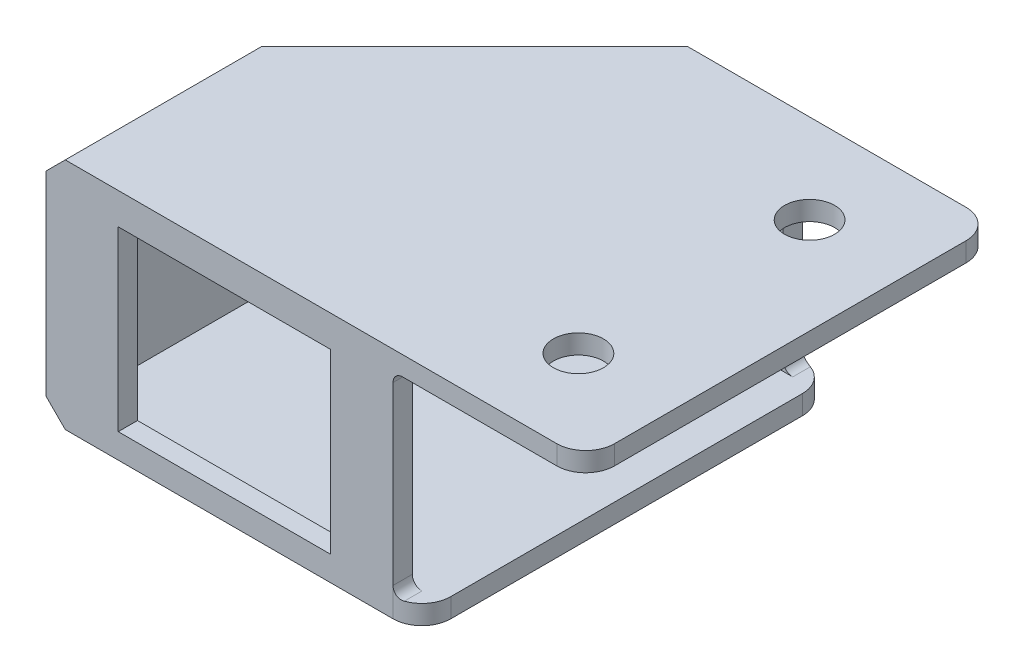
ISO-10303-21;
HEADER;
FILE_DESCRIPTION(('STEP AP214'),'2;1');
FILE_NAME('part.step','',(''),(''),'','','');
FILE_SCHEMA(('AUTOMOTIVE_DESIGN { 1 0 10303 214 1 1 1 1 }'));
ENDSEC;
DATA;
#1=APPLICATION_CONTEXT('core data for automotive mechanical design processes');
#2=APPLICATION_PROTOCOL_DEFINITION('international standard','automotive_design',2000,#1);
#3=PRODUCT_CONTEXT('',#1,'mechanical');
#4=PRODUCT('Part','Part','',(#3));
#5=PRODUCT_RELATED_PRODUCT_CATEGORY('part','',(#4));
#6=PRODUCT_DEFINITION_FORMATION('','',#4);
#7=PRODUCT_DEFINITION_CONTEXT('part definition',#1,'design');
#8=PRODUCT_DEFINITION('design','',#6,#7);
#9=PRODUCT_DEFINITION_SHAPE('','',#8);
#10=(LENGTH_UNIT() NAMED_UNIT(*) SI_UNIT(.MILLI.,.METRE.));
#11=(NAMED_UNIT(*) PLANE_ANGLE_UNIT() SI_UNIT($,.RADIAN.));
#12=(NAMED_UNIT(*) SI_UNIT($,.STERADIAN.) SOLID_ANGLE_UNIT());
#13=UNCERTAINTY_MEASURE_WITH_UNIT(LENGTH_MEASURE(1.E-05),#10,'distance_accuracy_value','');
#14=(GEOMETRIC_REPRESENTATION_CONTEXT(3) GLOBAL_UNCERTAINTY_ASSIGNED_CONTEXT((#13)) GLOBAL_UNIT_ASSIGNED_CONTEXT((#10,
#11,#12)) REPRESENTATION_CONTEXT('',''));
#15=CARTESIAN_POINT('',(0.,0.,0.));
#16=DIRECTION('',(0.,0.,1.));
#17=DIRECTION('',(1.,0.,0.));
#18=AXIS2_PLACEMENT_3D('',#15,#16,#17);
#19=CARTESIAN_POINT('',(26.409748294383,-43.8545194167415,42.5));
#20=DIRECTION('',(1.,0.,0.));
#21=DIRECTION('',(0.,0.,-1.));
#22=AXIS2_PLACEMENT_3D('',#19,#20,#21);
#23=PLANE('',#22);
#24=DIRECTION('',(0.,-1.,0.));
#25=VECTOR('',#24,1.);
#26=CARTESIAN_POINT('',(26.409748294383,3.77470202541257,40.5));
#27=LINE('',#26,#25);
#28=CARTESIAN_POINT('',(26.409748294383,12.8997020254126,40.5));
#29=VERTEX_POINT('',#28);
#30=CARTESIAN_POINT('',(26.409748294383,-5.35029797458743,40.5));
#31=VERTEX_POINT('',#30);
#32=EDGE_CURVE('E228',#29,#31,#27,.T.);
#33=ORIENTED_EDGE('',*,*,#32,.F.);
#34=DIRECTION('',(0.,0.,-1.));
#35=VECTOR('',#34,1.);
#36=CARTESIAN_POINT('',(26.409748294383,12.8997020254126,42.5));
#37=LINE('',#36,#35);
#38=CARTESIAN_POINT('',(26.409748294383,12.8997020254126,42.5));
#39=VERTEX_POINT('',#38);
#40=EDGE_CURVE('E426',#29,#39,#37,.F.);
#41=ORIENTED_EDGE('',*,*,#40,.T.);
#42=DIRECTION('',(0.,-1.,0.));
#43=VECTOR('',#42,1.);
#44=CARTESIAN_POINT('',(26.409748294383,-43.8545194167415,42.5));
#45=LINE('',#44,#43);
#46=CARTESIAN_POINT('',(26.409748294383,-5.35029797458743,42.5));
#47=VERTEX_POINT('',#46);
#48=EDGE_CURVE('E315',#39,#47,#45,.T.);
#49=ORIENTED_EDGE('',*,*,#48,.T.);
#50=DIRECTION('',(0.,0.,-1.));
#51=VECTOR('',#50,1.);
#52=CARTESIAN_POINT('',(26.409748294383,-5.35029797458743,40.5));
#53=LINE('',#52,#51);
#54=EDGE_CURVE('E423',#47,#31,#53,.T.);
#55=ORIENTED_EDGE('',*,*,#54,.T.);
#56=EDGE_LOOP('',(#33,#41,#49,#55));
#57=FACE_BOUND('',#56,.T.);
#58=ADVANCED_FACE('F35',(#57),#23,.T.);
#59=CARTESIAN_POINT('',(-7.620251705617,-43.8545194167415,42.5));
#60=DIRECTION('',(1.,0.,0.));
#61=DIRECTION('',(0.,0.,-1.));
#62=AXIS2_PLACEMENT_3D('',#59,#60,#61);
#63=PLANE('',#62);
#64=DIRECTION('',(0.,0.,-1.));
#65=VECTOR('',#64,1.);
#66=CARTESIAN_POINT('',(-7.620251705617,-6.35029797458743,42.5));
#67=LINE('',#66,#65);
#68=CARTESIAN_POINT('',(-7.620251705617,-6.35029797458743,40.5));
#69=VERTEX_POINT('',#68);
#70=CARTESIAN_POINT('',(-7.620251705617,-6.35029797458743,22.0784271247462));
#71=VERTEX_POINT('',#70);
#72=EDGE_CURVE('E319',#69,#71,#67,.T.);
#73=ORIENTED_EDGE('',*,*,#72,.T.);
#74=DIRECTION('',(0.,-1.,0.));
#75=VECTOR('',#74,1.);
#76=CARTESIAN_POINT('',(-7.62025170564407,500000.,22.0784271247462));
#77=LINE('',#76,#75);
#78=CARTESIAN_POINT('',(-7.62025170561699,13.899702025526,22.0784271247462));
#79=VERTEX_POINT('',#78);
#80=EDGE_CURVE('E237',#79,#71,#77,.T.);
#81=ORIENTED_EDGE('',*,*,#80,.F.);
#82=DIRECTION('',(0.,0.,-1.));
#83=VECTOR('',#82,1.);
#84=CARTESIAN_POINT('',(-7.62025170561699,13.8997020254126,42.5));
#85=LINE('',#84,#83);
#86=CARTESIAN_POINT('',(-7.62025170561699,13.8997020254126,40.5));
#87=VERTEX_POINT('',#86);
#88=EDGE_CURVE('E244',#87,#79,#85,.T.);
#89=ORIENTED_EDGE('',*,*,#88,.F.);
#90=DIRECTION('',(0.,-1.,0.));
#91=VECTOR('',#90,1.);
#92=CARTESIAN_POINT('',(-7.62025170561699,13.8997020254126,40.5));
#93=LINE('',#92,#91);
#94=EDGE_CURVE('E303',#87,#69,#93,.T.);
#95=ORIENTED_EDGE('',*,*,#94,.T.);
#96=EDGE_LOOP('',(#73,#81,#89,#95));
#97=FACE_BOUND('',#96,.T.);
#98=ADVANCED_FACE('F493',(#97),#63,.T.);
#99=CARTESIAN_POINT('',(18.394748294383,15.8997020254126,42.5));
#100=DIRECTION('',(0.,1.,0.));
#101=DIRECTION('',(0.,0.,1.));
#102=AXIS2_PLACEMENT_3D('',#99,#100,#101);
#103=PLANE('',#102);
#104=DIRECTION('',(1.,0.,0.));
#105=VECTOR('',#104,1.);
#106=CARTESIAN_POINT('',(18.394748294383,15.8997020254126,0.));
#107=LINE('',#106,#105);
#108=CARTESIAN_POINT('',(14.4581754191293,15.8997020254126,0.));
#109=VERTEX_POINT('',#108);
#110=CARTESIAN_POINT('',(43.409748294383,15.8997020254126,0.));
#111=VERTEX_POINT('',#110);
#112=EDGE_CURVE('E306',#109,#111,#107,.T.);
#113=ORIENTED_EDGE('',*,*,#112,.F.);
#114=DIRECTION('',(-0.707106781186548,0.,0.707106781186548));
#115=VECTOR('',#114,1.);
#116=CARTESIAN_POINT('',(-8.20603814324379,15.8997020254126,22.6642135623731));
#117=LINE('',#116,#115);
#118=CARTESIAN_POINT('',(-7.62025170561698,15.8997020254126,22.0784271247463));
#119=VERTEX_POINT('',#118);
#120=EDGE_CURVE('E388',#109,#119,#117,.T.);
#121=ORIENTED_EDGE('',*,*,#120,.T.);
#122=DIRECTION('',(0.,0.,1.));
#123=VECTOR('',#122,1.);
#124=CARTESIAN_POINT('',(-7.62025170561698,15.8997020254126,42.5));
#125=LINE('',#124,#123);
#126=CARTESIAN_POINT('',(-7.62025170561695,15.8997020254126,42.5));
#127=VERTEX_POINT('',#126);
#128=EDGE_CURVE('E382',#119,#127,#125,.T.);
#129=ORIENTED_EDGE('',*,*,#128,.T.);
#130=DIRECTION('',(1.,0.,0.));
#131=VECTOR('',#130,1.);
#132=CARTESIAN_POINT('',(18.394748294383,15.8997020254126,42.5));
#133=LINE('',#132,#131);
#134=CARTESIAN_POINT('',(43.409748294383,15.8997020254126,42.5));
#135=VERTEX_POINT('',#134);
#136=EDGE_CURVE('E307',#127,#135,#133,.T.);
#137=ORIENTED_EDGE('',*,*,#136,.T.);
#138=CARTESIAN_POINT('',(43.409748294383,15.8997020254126,39.5));
#139=DIRECTION('',(0.,1.,0.));
#140=DIRECTION('',(0.,0.,1.));
#141=AXIS2_PLACEMENT_3D('',#138,#139,#140);
#142=CIRCLE('',#141,3.);
#143=CARTESIAN_POINT('',(46.409748294383,15.8997020254126,39.5));
#144=VERTEX_POINT('',#143);
#145=EDGE_CURVE('E358',#135,#144,#142,.T.);
#146=ORIENTED_EDGE('',*,*,#145,.T.);
#147=DIRECTION('',(0.,0.,-1.));
#148=VECTOR('',#147,1.);
#149=CARTESIAN_POINT('',(46.409748294383,15.8997020254126,42.5));
#150=LINE('',#149,#148);
#151=CARTESIAN_POINT('',(46.409748294383,15.8997020254126,3.));
#152=VERTEX_POINT('',#151);
#153=EDGE_CURVE('E327',#144,#152,#150,.T.);
#154=ORIENTED_EDGE('',*,*,#153,.T.);
#155=CARTESIAN_POINT('',(43.409748294383,15.8997020254126,3.));
#156=DIRECTION('',(0.,1.,0.));
#157=DIRECTION('',(0.,0.,1.));
#158=AXIS2_PLACEMENT_3D('',#155,#156,#157);
#159=CIRCLE('',#158,3.);
#160=EDGE_CURVE('E360',#152,#111,#159,.T.);
#161=ORIENTED_EDGE('',*,*,#160,.T.);
#162=EDGE_LOOP('',(#113,#121,#129,#137,#146,#154,#161));
#163=FACE_BOUND('',#162,.T.);
#164=CARTESIAN_POINT('',(36.409748294383,15.8997020254126,33.25));
#165=DIRECTION('',(0.,1.,0.));
#166=DIRECTION('',(0.,0.,1.));
#167=AXIS2_PLACEMENT_3D('',#164,#165,#166);
#168=CIRCLE('',#167,2.6);
#169=CARTESIAN_POINT('',(36.409748294383,15.8997020254126,35.85));
#170=VERTEX_POINT('',#169);
#171=EDGE_CURVE('E255',#170,#170,#168,.T.);
#172=ORIENTED_EDGE('',*,*,#171,.F.);
#173=EDGE_LOOP('',(#172));
#174=FACE_BOUND('',#173,.T.);
#175=CARTESIAN_POINT('',(36.409748294383,15.8997020254126,9.25));
#176=DIRECTION('',(0.,1.,0.));
#177=DIRECTION('',(0.,0.,1.));
#178=AXIS2_PLACEMENT_3D('',#175,#176,#177);
#179=CIRCLE('',#178,2.6);
#180=CARTESIAN_POINT('',(36.409748294383,15.8997020254126,11.85));
#181=VERTEX_POINT('',#180);
#182=EDGE_CURVE('E250',#181,#181,#179,.F.);
#183=ORIENTED_EDGE('',*,*,#182,.T.);
#184=EDGE_LOOP('',(#183));
#185=FACE_BOUND('',#184,.T.);
#186=ADVANCED_FACE('F500',(#163,#174,#185),#103,.T.);
#187=CARTESIAN_POINT('',(18.394748294383,13.8997020254126,42.5));
#188=DIRECTION('',(0.,1.,0.));
#189=DIRECTION('',(0.,0.,1.));
#190=AXIS2_PLACEMENT_3D('',#187,#188,#189);
#191=PLANE('',#190);
#192=DIRECTION('',(1.,0.,0.));
#193=VECTOR('',#192,1.);
#194=CARTESIAN_POINT('',(24.4097482943559,13.8997020254124,2.));
#195=LINE('',#194,#193);
#196=CARTESIAN_POINT('',(12.4581754191292,13.899702025526,2.));
#197=VERTEX_POINT('',#196);
#198=CARTESIAN_POINT('',(27.409748294383,13.8997020254124,2.));
#199=VERTEX_POINT('',#198);
#200=EDGE_CURVE('E215',#197,#199,#195,.T.);
#201=ORIENTED_EDGE('',*,*,#200,.T.);
#202=DIRECTION('',(0.,0.,-1.));
#203=VECTOR('',#202,1.);
#204=CARTESIAN_POINT('',(27.409748294383,13.8997020254126,42.5));
#205=LINE('',#204,#203);
#206=CARTESIAN_POINT('',(27.409748294383,13.8997020254126,0.));
#207=VERTEX_POINT('',#206);
#208=EDGE_CURVE('E416',#199,#207,#205,.T.);
#209=ORIENTED_EDGE('',*,*,#208,.T.);
#210=DIRECTION('',(1.,0.,0.));
#211=VECTOR('',#210,1.);
#212=CARTESIAN_POINT('',(18.394748294383,13.8997020254126,0.));
#213=LINE('',#212,#211);
#214=CARTESIAN_POINT('',(43.409748294383,13.8997020254126,0.));
#215=VERTEX_POINT('',#214);
#216=EDGE_CURVE('E310',#207,#215,#213,.T.);
#217=ORIENTED_EDGE('',*,*,#216,.T.);
#218=CARTESIAN_POINT('',(43.409748294383,13.8997020254126,3.));
#219=DIRECTION('',(0.,1.,0.));
#220=DIRECTION('',(0.,0.,1.));
#221=AXIS2_PLACEMENT_3D('',#218,#219,#220);
#222=CIRCLE('',#221,3.);
#223=CARTESIAN_POINT('',(46.409748294383,13.8997020254126,3.));
#224=VERTEX_POINT('',#223);
#225=EDGE_CURVE('E351',#215,#224,#222,.F.);
#226=ORIENTED_EDGE('',*,*,#225,.T.);
#227=DIRECTION('',(0.,0.,-1.));
#228=VECTOR('',#227,1.);
#229=CARTESIAN_POINT('',(46.409748294383,13.8997020254126,42.5));
#230=LINE('',#229,#228);
#231=CARTESIAN_POINT('',(46.409748294383,13.8997020254126,39.5));
#232=VERTEX_POINT('',#231);
#233=EDGE_CURVE('E330',#232,#224,#230,.T.);
#234=ORIENTED_EDGE('',*,*,#233,.F.);
#235=CARTESIAN_POINT('',(43.409748294383,13.8997020254126,39.5));
#236=DIRECTION('',(0.,1.,0.));
#237=DIRECTION('',(0.,0.,1.));
#238=AXIS2_PLACEMENT_3D('',#235,#236,#237);
#239=CIRCLE('',#238,3.);
#240=CARTESIAN_POINT('',(43.409748294383,13.8997020254126,42.5));
#241=VERTEX_POINT('',#240);
#242=EDGE_CURVE('E348',#232,#241,#239,.F.);
#243=ORIENTED_EDGE('',*,*,#242,.T.);
#244=DIRECTION('',(1.,0.,0.));
#245=VECTOR('',#244,1.);
#246=CARTESIAN_POINT('',(18.394748294383,13.8997020254126,42.5));
#247=LINE('',#246,#245);
#248=CARTESIAN_POINT('',(27.409748294383,13.8997020254126,42.5));
#249=VERTEX_POINT('',#248);
#250=EDGE_CURVE('E317',#249,#241,#247,.T.);
#251=ORIENTED_EDGE('',*,*,#250,.F.);
#252=DIRECTION('',(0.,0.,-1.));
#253=VECTOR('',#252,1.);
#254=CARTESIAN_POINT('',(27.409748294383,13.8997020254126,42.5));
#255=LINE('',#254,#253);
#256=CARTESIAN_POINT('',(27.409748294383,13.8997020254126,40.5));
#257=VERTEX_POINT('',#256);
#258=EDGE_CURVE('E409',#249,#257,#255,.T.);
#259=ORIENTED_EDGE('',*,*,#258,.T.);
#260=DIRECTION('',(-1.,0.,0.));
#261=VECTOR('',#260,1.);
#262=CARTESIAN_POINT('',(-7.62025170561699,13.8997020254126,40.5));
#263=LINE('',#262,#261);
#264=EDGE_CURVE('E301',#257,#87,#263,.T.);
#265=ORIENTED_EDGE('',*,*,#264,.T.);
#266=ORIENTED_EDGE('',*,*,#88,.T.);
#267=DIRECTION('',(0.707106781186548,0.,-0.707106781186547));
#268=VECTOR('',#267,1.);
#269=CARTESIAN_POINT('',(12.4581754191157,13.8997020254124,2.00000000001354));
#270=LINE('',#269,#268);
#271=EDGE_CURVE('E227',#79,#197,#270,.T.);
#272=ORIENTED_EDGE('',*,*,#271,.T.);
#273=EDGE_LOOP('',(#201,#209,#217,#226,#234,#243,#251,#259,#265,#266,#272));
#274=FACE_BOUND('',#273,.T.);
#275=CARTESIAN_POINT('',(36.409748294383,13.8997020254126,33.25));
#276=DIRECTION('',(0.,1.,0.));
#277=DIRECTION('',(0.,0.,1.));
#278=AXIS2_PLACEMENT_3D('',#275,#276,#277);
#279=CIRCLE('',#278,2.6);
#280=CARTESIAN_POINT('',(36.409748294383,13.8997020254126,35.85));
#281=VERTEX_POINT('',#280);
#282=EDGE_CURVE('E258',#281,#281,#279,.T.);
#283=ORIENTED_EDGE('',*,*,#282,.T.);
#284=EDGE_LOOP('',(#283));
#285=FACE_BOUND('',#284,.T.);
#286=CARTESIAN_POINT('',(36.409748294383,13.8997020254126,9.25));
#287=DIRECTION('',(0.,1.,0.));
#288=DIRECTION('',(0.,0.,1.));
#289=AXIS2_PLACEMENT_3D('',#286,#287,#288);
#290=CIRCLE('',#289,2.6);
#291=CARTESIAN_POINT('',(36.409748294383,13.8997020254126,11.85));
#292=VERTEX_POINT('',#291);
#293=EDGE_CURVE('E253',#292,#292,#290,.F.);
#294=ORIENTED_EDGE('',*,*,#293,.F.);
#295=EDGE_LOOP('',(#294));
#296=FACE_BOUND('',#295,.T.);
#297=ADVANCED_FACE('F240',(#274,#285,#296),#191,.F.);
#298=CARTESIAN_POINT('',(-9.620251705617,-43.8545194167415,42.5));
#299=DIRECTION('',(1.,0.,0.));
#300=DIRECTION('',(0.,0.,-1.));
#301=AXIS2_PLACEMENT_3D('',#298,#299,#300);
#302=PLANE('',#301);
#303=DIRECTION('',(0.,-1.,0.));
#304=VECTOR('',#303,1.);
#305=CARTESIAN_POINT('',(-9.620251705617,-43.8545194167415,42.5));
#306=LINE('',#305,#304);
#307=CARTESIAN_POINT('',(-9.620251705617,13.8997020254125,42.5));
#308=VERTEX_POINT('',#307);
#309=CARTESIAN_POINT('',(-9.620251705617,-6.35029797458742,42.5));
#310=VERTEX_POINT('',#309);
#311=EDGE_CURVE('E309',#308,#310,#306,.T.);
#312=ORIENTED_EDGE('',*,*,#311,.F.);
#313=DIRECTION('',(0.,0.,-1.));
#314=VECTOR('',#313,1.);
#315=CARTESIAN_POINT('',(-9.620251705617,13.8997020254126,21.25));
#316=LINE('',#315,#314);
#317=CARTESIAN_POINT('',(-9.6202517056169,13.8997020254126,21.25));
#318=VERTEX_POINT('',#317);
#319=EDGE_CURVE('E398',#308,#318,#316,.T.);
#320=ORIENTED_EDGE('',*,*,#319,.T.);
#321=DIRECTION('',(0.,-1.,0.));
#322=VECTOR('',#321,1.);
#323=CARTESIAN_POINT('',(-9.6202517056169,15.8997020254127,21.25));
#324=LINE('',#323,#322);
#325=CARTESIAN_POINT('',(-9.62025170561696,-6.35029797458743,21.25));
#326=VERTEX_POINT('',#325);
#327=EDGE_CURVE('E259',#318,#326,#324,.T.);
#328=ORIENTED_EDGE('',*,*,#327,.T.);
#329=DIRECTION('',(0.,0.,1.));
#330=VECTOR('',#329,1.);
#331=CARTESIAN_POINT('',(-9.620251705617,-6.35029797458742,42.5));
#332=LINE('',#331,#330);
#333=EDGE_CURVE('E396',#326,#310,#332,.T.);
#334=ORIENTED_EDGE('',*,*,#333,.T.);
#335=EDGE_LOOP('',(#312,#320,#328,#334));
#336=FACE_BOUND('',#335,.T.);
#337=ADVANCED_FACE('F582',(#336),#302,.F.);
#338=CARTESIAN_POINT('',(18.394748294383,-8.35029797458743,42.5));
#339=DIRECTION('',(0.,1.,0.));
#340=DIRECTION('',(0.,0.,1.));
#341=AXIS2_PLACEMENT_3D('',#338,#339,#340);
#342=PLANE('',#341);
#343=DIRECTION('',(0.,0.,-1.));
#344=VECTOR('',#343,1.);
#345=CARTESIAN_POINT('',(-7.620251705617,-8.35029797458743,42.5));
#346=LINE('',#345,#344);
#347=CARTESIAN_POINT('',(-7.620251705617,-8.35029797458743,42.5));
#348=VERTEX_POINT('',#347);
#349=CARTESIAN_POINT('',(-7.620251705617,-8.35029797458743,22.0784271247462));
#350=VERTEX_POINT('',#349);
#351=EDGE_CURVE('E405',#348,#350,#346,.T.);
#352=ORIENTED_EDGE('',*,*,#351,.T.);
#353=DIRECTION('',(0.707106781186548,0.,-0.707106781186548));
#354=VECTOR('',#353,1.);
#355=CARTESIAN_POINT('',(-4.82353814324389,-8.35029797458743,19.2817135623731));
#356=LINE('',#355,#354);
#357=CARTESIAN_POINT('',(14.4581754191292,-8.35029797458743,0.));
#358=VERTEX_POINT('',#357);
#359=EDGE_CURVE('E407',#350,#358,#356,.T.);
#360=ORIENTED_EDGE('',*,*,#359,.T.);
#361=DIRECTION('',(1.,0.,0.));
#362=VECTOR('',#361,1.);
#363=CARTESIAN_POINT('',(18.394748294383,-8.35029797458743,0.));
#364=LINE('',#363,#362);
#365=CARTESIAN_POINT('',(26.409748294383,-8.35029797458743,0.));
#366=VERTEX_POINT('',#365);
#367=EDGE_CURVE('E321',#358,#366,#364,.T.);
#368=ORIENTED_EDGE('',*,*,#367,.T.);
#369=CARTESIAN_POINT('',(26.409748294383,-8.35029797458743,3.));
#370=DIRECTION('',(0.,1.,0.));
#371=DIRECTION('',(0.,0.,1.));
#372=AXIS2_PLACEMENT_3D('',#369,#370,#371);
#373=CIRCLE('',#372,3.);
#374=CARTESIAN_POINT('',(29.409748294383,-8.35029797458742,3.));
#375=VERTEX_POINT('',#374);
#376=EDGE_CURVE('E366',#366,#375,#373,.F.);
#377=ORIENTED_EDGE('',*,*,#376,.T.);
#378=DIRECTION('',(0.,0.,-1.));
#379=VECTOR('',#378,1.);
#380=CARTESIAN_POINT('',(29.409748294383,-8.35029797458742,42.5));
#381=LINE('',#380,#379);
#382=CARTESIAN_POINT('',(29.409748294383,-8.35029797458742,39.5));
#383=VERTEX_POINT('',#382);
#384=EDGE_CURVE('E336',#383,#375,#381,.T.);
#385=ORIENTED_EDGE('',*,*,#384,.F.);
#386=CARTESIAN_POINT('',(26.409748294383,-8.35029797458743,39.5));
#387=DIRECTION('',(0.,1.,0.));
#388=DIRECTION('',(0.,0.,1.));
#389=AXIS2_PLACEMENT_3D('',#386,#387,#388);
#390=CIRCLE('',#389,3.);
#391=CARTESIAN_POINT('',(26.409748294383,-8.35029797458743,42.5));
#392=VERTEX_POINT('',#391);
#393=EDGE_CURVE('E363',#383,#392,#390,.F.);
#394=ORIENTED_EDGE('',*,*,#393,.T.);
#395=DIRECTION('',(1.,0.,0.));
#396=VECTOR('',#395,1.);
#397=CARTESIAN_POINT('',(18.394748294383,-8.35029797458743,42.5));
#398=LINE('',#397,#396);
#399=EDGE_CURVE('E313',#348,#392,#398,.T.);
#400=ORIENTED_EDGE('',*,*,#399,.F.);
#401=EDGE_LOOP('',(#352,#360,#368,#377,#385,#394,#400));
#402=FACE_BOUND('',#401,.T.);
#403=ADVANCED_FACE('F563',(#402),#342,.F.);
#404=CARTESIAN_POINT('',(29.409748294383,-43.8545194167415,42.5));
#405=DIRECTION('',(1.,0.,0.));
#406=DIRECTION('',(0.,0.,-1.));
#407=AXIS2_PLACEMENT_3D('',#404,#405,#406);
#408=PLANE('',#407);
#409=ORIENTED_EDGE('',*,*,#384,.T.);
#410=DIRECTION('',(0.,-1.,0.));
#411=VECTOR('',#410,1.);
#412=CARTESIAN_POINT('',(29.409748294383,-6.35029797458743,3.));
#413=LINE('',#412,#411);
#414=CARTESIAN_POINT('',(29.409748294383,-6.35029797458743,3.));
#415=VERTEX_POINT('',#414);
#416=EDGE_CURVE('E371',#375,#415,#413,.F.);
#417=ORIENTED_EDGE('',*,*,#416,.T.);
#418=DIRECTION('',(0.,0.,-1.));
#419=VECTOR('',#418,1.);
#420=CARTESIAN_POINT('',(29.409748294383,-6.35029797458743,42.5));
#421=LINE('',#420,#419);
#422=CARTESIAN_POINT('',(29.409748294383,-6.35029797458743,39.5));
#423=VERTEX_POINT('',#422);
#424=EDGE_CURVE('E333',#423,#415,#421,.T.);
#425=ORIENTED_EDGE('',*,*,#424,.F.);
#426=DIRECTION('',(0.,-1.,0.));
#427=VECTOR('',#426,1.);
#428=CARTESIAN_POINT('',(29.409748294383,-43.8545194167415,39.5));
#429=LINE('',#428,#427);
#430=EDGE_CURVE('E368',#423,#383,#429,.T.);
#431=ORIENTED_EDGE('',*,*,#430,.T.);
#432=EDGE_LOOP('',(#409,#417,#425,#431));
#433=FACE_BOUND('',#432,.T.);
#434=ADVANCED_FACE('F517',(#433),#408,.T.);
#435=CARTESIAN_POINT('',(18.394748294383,-6.35029797458743,42.5));
#436=DIRECTION('',(0.,1.,0.));
#437=DIRECTION('',(0.,0.,1.));
#438=AXIS2_PLACEMENT_3D('',#435,#436,#437);
#439=PLANE('',#438);
#440=DIRECTION('',(1.,0.,0.));
#441=VECTOR('',#440,1.);
#442=CARTESIAN_POINT('',(-7.620251705617,-6.35029797458743,40.5));
#443=LINE('',#442,#441);
#444=CARTESIAN_POINT('',(27.409748294383,-6.35029797458743,40.5));
#445=VERTEX_POINT('',#444);
#446=EDGE_CURVE('E293',#69,#445,#443,.T.);
#447=ORIENTED_EDGE('',*,*,#446,.T.);
#448=DIRECTION('',(0.,0.,-1.));
#449=VECTOR('',#448,1.);
#450=CARTESIAN_POINT('',(27.409748294383,-6.35029797458743,42.5));
#451=LINE('',#450,#449);
#452=CARTESIAN_POINT('',(27.409748294383,-6.35029797458743,42.3284271247462));
#453=VERTEX_POINT('',#452);
#454=EDGE_CURVE('E431',#445,#453,#451,.F.);
#455=ORIENTED_EDGE('',*,*,#454,.T.);
#456=CARTESIAN_POINT('',(26.409748294383,-6.35029797458743,39.5));
#457=DIRECTION('',(0.,1.,0.));
#458=DIRECTION('',(0.,0.,1.));
#459=AXIS2_PLACEMENT_3D('',#456,#457,#458);
#460=CIRCLE('',#459,3.);
#461=EDGE_CURVE('E373',#453,#423,#460,.T.);
#462=ORIENTED_EDGE('',*,*,#461,.T.);
#463=ORIENTED_EDGE('',*,*,#424,.T.);
#464=CARTESIAN_POINT('',(26.409748294383,-6.35029797458743,3.));
#465=DIRECTION('',(0.,1.,0.));
#466=DIRECTION('',(0.,0.,1.));
#467=AXIS2_PLACEMENT_3D('',#464,#465,#466);
#468=CIRCLE('',#467,3.);
#469=CARTESIAN_POINT('',(27.409748294383,-6.35029797458743,0.171572875253809));
#470=VERTEX_POINT('',#469);
#471=EDGE_CURVE('E375',#415,#470,#468,.T.);
#472=ORIENTED_EDGE('',*,*,#471,.T.);
#473=DIRECTION('',(0.,0.,-1.));
#474=VECTOR('',#473,1.);
#475=CARTESIAN_POINT('',(27.409748294383,-6.35029797458743,2.));
#476=LINE('',#475,#474);
#477=CARTESIAN_POINT('',(27.409748294383,-6.35029797458743,2.));
#478=VERTEX_POINT('',#477);
#479=EDGE_CURVE('E428',#470,#478,#476,.F.);
#480=ORIENTED_EDGE('',*,*,#479,.T.);
#481=DIRECTION('',(1.,0.,0.));
#482=VECTOR('',#481,1.);
#483=CARTESIAN_POINT('',(24.409748294383,-6.35029797458743,2.));
#484=LINE('',#483,#482);
#485=CARTESIAN_POINT('',(12.4581754191292,-6.35029797458743,2.));
#486=VERTEX_POINT('',#485);
#487=EDGE_CURVE('E236',#486,#478,#484,.T.);
#488=ORIENTED_EDGE('',*,*,#487,.F.);
#489=DIRECTION('',(0.707106781186548,0.,-0.707106781186547));
#490=VECTOR('',#489,1.);
#491=CARTESIAN_POINT('',(12.4581754191292,-6.35029797458743,2.));
#492=LINE('',#491,#490);
#493=EDGE_CURVE('E234',#71,#486,#492,.T.);
#494=ORIENTED_EDGE('',*,*,#493,.F.);
#495=ORIENTED_EDGE('',*,*,#72,.F.);
#496=EDGE_LOOP('',(#447,#455,#462,#463,#472,#480,#488,#494,#495));
#497=FACE_BOUND('',#496,.T.);
#498=ADVANCED_FACE('F508',(#497),#439,.T.);
#499=DIRECTION('',(0.,-1.,0.));
#500=VECTOR('',#499,1.);
#501=CARTESIAN_POINT('',(26.409748294383,-43.8545194167415,0.));
#502=LINE('',#501,#500);
#503=CARTESIAN_POINT('',(26.409748294383,12.8997020254126,0.));
#504=VERTEX_POINT('',#503);
#505=CARTESIAN_POINT('',(26.409748294383,-5.35029797458743,0.));
#506=VERTEX_POINT('',#505);
#507=EDGE_CURVE('E323',#504,#506,#502,.T.);
#508=ORIENTED_EDGE('',*,*,#507,.F.);
#509=DIRECTION('',(0.,0.,-1.));
#510=VECTOR('',#509,1.);
#511=CARTESIAN_POINT('',(26.409748294383,12.8997020254126,42.5));
#512=LINE('',#511,#510);
#513=CARTESIAN_POINT('',(26.409748294383,12.8997020254126,2.));
#514=VERTEX_POINT('',#513);
#515=EDGE_CURVE('E421',#504,#514,#512,.F.);
#516=ORIENTED_EDGE('',*,*,#515,.T.);
#517=DIRECTION('',(0.,1.,0.));
#518=VECTOR('',#517,1.);
#519=CARTESIAN_POINT('',(26.409748294383,3.77470202541258,2.));
#520=LINE('',#519,#518);
#521=CARTESIAN_POINT('',(26.409748294383,-5.35029797458743,2.));
#522=VERTEX_POINT('',#521);
#523=EDGE_CURVE('E548',#522,#514,#520,.T.);
#524=ORIENTED_EDGE('',*,*,#523,.F.);
#525=DIRECTION('',(0.,0.,-1.));
#526=VECTOR('',#525,1.);
#527=CARTESIAN_POINT('',(26.409748294383,-5.35029797458743,0.));
#528=LINE('',#527,#526);
#529=EDGE_CURVE('E418',#522,#506,#528,.T.);
#530=ORIENTED_EDGE('',*,*,#529,.T.);
#531=EDGE_LOOP('',(#508,#516,#524,#530));
#532=FACE_BOUND('',#531,.T.);
#533=ADVANCED_FACE('F496',(#532),#23,.T.);
#534=CARTESIAN_POINT('',(46.409748294383,-43.8545194167415,42.5));
#535=DIRECTION('',(1.,0.,0.));
#536=DIRECTION('',(0.,0.,-1.));
#537=AXIS2_PLACEMENT_3D('',#534,#535,#536);
#538=PLANE('',#537);
#539=ORIENTED_EDGE('',*,*,#233,.T.);
#540=DIRECTION('',(0.,-1.,0.));
#541=VECTOR('',#540,1.);
#542=CARTESIAN_POINT('',(46.409748294383,15.8997020254126,3.));
#543=LINE('',#542,#541);
#544=EDGE_CURVE('E356',#224,#152,#543,.F.);
#545=ORIENTED_EDGE('',*,*,#544,.T.);
#546=ORIENTED_EDGE('',*,*,#153,.F.);
#547=DIRECTION('',(0.,-1.,0.));
#548=VECTOR('',#547,1.);
#549=CARTESIAN_POINT('',(46.409748294383,-43.8545194167415,39.5));
#550=LINE('',#549,#548);
#551=EDGE_CURVE('E353',#144,#232,#550,.T.);
#552=ORIENTED_EDGE('',*,*,#551,.T.);
#553=EDGE_LOOP('',(#539,#545,#546,#552));
#554=FACE_BOUND('',#553,.T.);
#555=ADVANCED_FACE('F507',(#554),#538,.T.);
#556=CARTESIAN_POINT('',(18.394748294383,-43.8545194167415,42.5));
#557=DIRECTION('',(0.,0.,1.));
#558=DIRECTION('',(1.,0.,0.));
#559=AXIS2_PLACEMENT_3D('',#556,#557,#558);
#560=PLANE('',#559);
#561=ORIENTED_EDGE('',*,*,#136,.F.);
#562=DIRECTION('',(-0.707106781186549,-0.707106781186546,0.));
#563=VECTOR('',#562,1.);
#564=CARTESIAN_POINT('',(-24.489862426694,-0.969908695664386,42.5));
#565=LINE('',#564,#563);
#566=EDGE_CURVE('E403',#127,#308,#565,.T.);
#567=ORIENTED_EDGE('',*,*,#566,.T.);
#568=ORIENTED_EDGE('',*,*,#311,.T.);
#569=DIRECTION('',(-0.707106781186545,0.70710678118655,0.));
#570=VECTOR('',#569,1.);
#571=CARTESIAN_POINT('',(23.13935901546,-39.1099086956646,42.5));
#572=LINE('',#571,#570);
#573=EDGE_CURVE('E401',#310,#348,#572,.F.);
#574=ORIENTED_EDGE('',*,*,#573,.T.);
#575=ORIENTED_EDGE('',*,*,#399,.T.);
#576=DIRECTION('',(0.,-1.,0.));
#577=VECTOR('',#576,1.);
#578=CARTESIAN_POINT('',(26.409748294383,-43.8545194167415,42.5));
#579=LINE('',#578,#577);
#580=EDGE_CURVE('E52',#392,#47,#579,.F.);
#581=ORIENTED_EDGE('',*,*,#580,.T.);
#582=ORIENTED_EDGE('',*,*,#48,.F.);
#583=CARTESIAN_POINT('',(27.409748294383,12.8997020254126,42.5));
#584=DIRECTION('',(0.,0.,1.));
#585=DIRECTION('',(1.,0.,0.));
#586=AXIS2_PLACEMENT_3D('',#583,#584,#585);
#587=CIRCLE('',#586,1.);
#588=EDGE_CURVE('E438',#39,#249,#587,.F.);
#589=ORIENTED_EDGE('',*,*,#588,.T.);
#590=ORIENTED_EDGE('',*,*,#250,.T.);
#591=DIRECTION('',(0.,-1.,0.));
#592=VECTOR('',#591,1.);
#593=CARTESIAN_POINT('',(43.409748294383,-43.8545194167415,42.5));
#594=LINE('',#593,#592);
#595=EDGE_CURVE('E379',#241,#135,#594,.F.);
#596=ORIENTED_EDGE('',*,*,#595,.T.);
#597=EDGE_LOOP('',(#561,#567,#568,#574,#575,#581,#582,#589,#590,#596));
#598=FACE_BOUND('',#597,.T.);
#599=DIRECTION('',(0.,-1.,0.));
#600=VECTOR('',#599,1.);
#601=CARTESIAN_POINT('',(-2.12025170561701,12.6325924540619,42.5));
#602=LINE('',#601,#600);
#603=CARTESIAN_POINT('',(-2.12025170561701,12.6325924540619,42.5));
#604=VERTEX_POINT('',#603);
#605=CARTESIAN_POINT('',(-2.12025170561701,-5.78740754593809,42.5));
#606=VERTEX_POINT('',#605);
#607=EDGE_CURVE('E267',#604,#606,#602,.T.);
#608=ORIENTED_EDGE('',*,*,#607,.F.);
#609=DIRECTION('',(-1.,0.,0.));
#610=VECTOR('',#609,1.);
#611=CARTESIAN_POINT('',(19.909748294383,12.6325924540619,42.5));
#612=LINE('',#611,#610);
#613=CARTESIAN_POINT('',(19.909748294383,12.6325924540619,42.5));
#614=VERTEX_POINT('',#613);
#615=EDGE_CURVE('E272',#614,#604,#612,.T.);
#616=ORIENTED_EDGE('',*,*,#615,.F.);
#617=DIRECTION('',(0.,1.,0.));
#618=VECTOR('',#617,1.);
#619=CARTESIAN_POINT('',(19.909748294383,-5.78740754593809,42.5));
#620=LINE('',#619,#618);
#621=CARTESIAN_POINT('',(19.909748294383,-5.78740754593809,42.5));
#622=VERTEX_POINT('',#621);
#623=EDGE_CURVE('E286',#622,#614,#620,.T.);
#624=ORIENTED_EDGE('',*,*,#623,.F.);
#625=DIRECTION('',(1.,0.,0.));
#626=VECTOR('',#625,1.);
#627=CARTESIAN_POINT('',(-2.12025170561701,-5.78740754593809,42.5));
#628=LINE('',#627,#626);
#629=EDGE_CURVE('E283',#606,#622,#628,.T.);
#630=ORIENTED_EDGE('',*,*,#629,.F.);
#631=EDGE_LOOP('',(#608,#616,#624,#630));
#632=FACE_BOUND('',#631,.T.);
#633=ADVANCED_FACE('F514',(#598,#632),#560,.T.);
#634=CARTESIAN_POINT('',(18.394748294383,-43.8545194167415,0.));
#635=DIRECTION('',(0.,0.,1.));
#636=DIRECTION('',(1.,0.,0.));
#637=AXIS2_PLACEMENT_3D('',#634,#635,#636);
#638=PLANE('',#637);
#639=DIRECTION('',(0.,-1.,0.));
#640=VECTOR('',#639,1.);
#641=CARTESIAN_POINT('',(11.629748294356,500000.,0.));
#642=LINE('',#641,#640);
#643=CARTESIAN_POINT('',(11.629748294383,13.899702025526,0.));
#644=VERTEX_POINT('',#643);
#645=CARTESIAN_POINT('',(11.629748294383,-6.35029797458743,0.));
#646=VERTEX_POINT('',#645);
#647=EDGE_CURVE('E245',#644,#646,#642,.T.);
#648=ORIENTED_EDGE('',*,*,#647,.F.);
#649=DIRECTION('',(0.816496580927728,0.577350269189624,0.));
#650=VECTOR('',#649,1.);
#651=CARTESIAN_POINT('',(1.60369971088049,6.81021508351213,0.));
#652=LINE('',#651,#650);
#653=EDGE_CURVE('E394',#644,#109,#652,.T.);
#654=ORIENTED_EDGE('',*,*,#653,.T.);
#655=ORIENTED_EDGE('',*,*,#112,.T.);
#656=DIRECTION('',(0.,-1.,0.));
#657=VECTOR('',#656,1.);
#658=CARTESIAN_POINT('',(43.409748294383,13.8997020254126,0.));
#659=LINE('',#658,#657);
#660=EDGE_CURVE('E345',#111,#215,#659,.T.);
#661=ORIENTED_EDGE('',*,*,#660,.T.);
#662=ORIENTED_EDGE('',*,*,#216,.F.);
#663=CARTESIAN_POINT('',(27.409748294383,12.8997020254126,0.));
#664=DIRECTION('',(0.,0.,1.));
#665=DIRECTION('',(1.,0.,0.));
#666=AXIS2_PLACEMENT_3D('',#663,#664,#665);
#667=CIRCLE('',#666,1.);
#668=EDGE_CURVE('E433',#207,#504,#667,.T.);
#669=ORIENTED_EDGE('',*,*,#668,.T.);
#670=ORIENTED_EDGE('',*,*,#507,.T.);
#671=DIRECTION('',(0.,-1.,0.));
#672=VECTOR('',#671,1.);
#673=CARTESIAN_POINT('',(26.409748294383,-8.35029797458742,0.));
#674=LINE('',#673,#672);
#675=EDGE_CURVE('E339',#506,#366,#674,.T.);
#676=ORIENTED_EDGE('',*,*,#675,.T.);
#677=ORIENTED_EDGE('',*,*,#367,.F.);
#678=DIRECTION('',(0.816496580927724,-0.577350269189629,0.));
#679=VECTOR('',#678,1.);
#680=CARTESIAN_POINT('',(-2.53691837228352,3.66704809222202,0.));
#681=LINE('',#680,#679);
#682=EDGE_CURVE('E391',#358,#646,#681,.F.);
#683=ORIENTED_EDGE('',*,*,#682,.T.);
#684=EDGE_LOOP('',(#648,#654,#655,#661,#662,#669,#670,#676,#677,#683));
#685=FACE_BOUND('',#684,.T.);
#686=ADVANCED_FACE('F527',(#685),#638,.F.);
#687=CARTESIAN_POINT('',(24.409748294383,-6.35029797458743,40.5));
#688=DIRECTION('',(0.,0.,1.));
#689=DIRECTION('',(1.,0.,0.));
#690=AXIS2_PLACEMENT_3D('',#687,#688,#689);
#691=PLANE('',#690);
#692=DIRECTION('',(-1.,0.,0.));
#693=VECTOR('',#692,1.);
#694=CARTESIAN_POINT('',(19.909748294383,12.6325924540619,40.5));
#695=LINE('',#694,#693);
#696=CARTESIAN_POINT('',(19.909748294383,12.6325924540619,40.5));
#697=VERTEX_POINT('',#696);
#698=CARTESIAN_POINT('',(-2.12025170561701,12.6325924540619,40.5));
#699=VERTEX_POINT('',#698);
#700=EDGE_CURVE('E278',#697,#699,#695,.T.);
#701=ORIENTED_EDGE('',*,*,#700,.T.);
#702=DIRECTION('',(0.,-1.,0.));
#703=VECTOR('',#702,1.);
#704=CARTESIAN_POINT('',(-2.12025170561701,12.6325924540619,40.5));
#705=LINE('',#704,#703);
#706=CARTESIAN_POINT('',(-2.12025170561701,-5.78740754593809,40.5));
#707=VERTEX_POINT('',#706);
#708=EDGE_CURVE('E268',#699,#707,#705,.T.);
#709=ORIENTED_EDGE('',*,*,#708,.T.);
#710=DIRECTION('',(1.,0.,0.));
#711=VECTOR('',#710,1.);
#712=CARTESIAN_POINT('',(-2.12025170561701,-5.78740754593809,40.5));
#713=LINE('',#712,#711);
#714=CARTESIAN_POINT('',(19.909748294383,-5.78740754593809,40.5));
#715=VERTEX_POINT('',#714);
#716=EDGE_CURVE('E271',#707,#715,#713,.T.);
#717=ORIENTED_EDGE('',*,*,#716,.T.);
#718=DIRECTION('',(0.,1.,0.));
#719=VECTOR('',#718,1.);
#720=CARTESIAN_POINT('',(19.909748294383,-5.78740754593809,40.5));
#721=LINE('',#720,#719);
#722=EDGE_CURVE('E275',#715,#697,#721,.T.);
#723=ORIENTED_EDGE('',*,*,#722,.T.);
#724=EDGE_LOOP('',(#701,#709,#717,#723));
#725=FACE_BOUND('',#724,.T.);
#726=ORIENTED_EDGE('',*,*,#446,.F.);
#727=ORIENTED_EDGE('',*,*,#94,.F.);
#728=ORIENTED_EDGE('',*,*,#264,.F.);
#729=CARTESIAN_POINT('',(27.409748294383,12.8997020254126,40.5));
#730=DIRECTION('',(0.,0.,1.));
#731=DIRECTION('',(1.,0.,0.));
#732=AXIS2_PLACEMENT_3D('',#729,#730,#731);
#733=CIRCLE('',#732,1.);
#734=EDGE_CURVE('E436',#257,#29,#733,.T.);
#735=ORIENTED_EDGE('',*,*,#734,.T.);
#736=ORIENTED_EDGE('',*,*,#32,.T.);
#737=CARTESIAN_POINT('',(27.409748294383,-5.35029797458743,40.5));
#738=DIRECTION('',(0.,0.,1.));
#739=DIRECTION('',(1.,0.,0.));
#740=AXIS2_PLACEMENT_3D('',#737,#738,#739);
#741=CIRCLE('',#740,1.);
#742=EDGE_CURVE('E440',#31,#445,#741,.T.);
#743=ORIENTED_EDGE('',*,*,#742,.T.);
#744=EDGE_LOOP('',(#726,#727,#728,#735,#736,#743));
#745=FACE_BOUND('',#744,.T.);
#746=ADVANCED_FACE('F546',(#725,#745),#691,.F.);
#747=CARTESIAN_POINT('',(-2.12025170561701,12.6325924540619,40.5));
#748=DIRECTION('',(-1.,0.,0.));
#749=DIRECTION('',(0.,0.,1.));
#750=AXIS2_PLACEMENT_3D('',#747,#748,#749);
#751=PLANE('',#750);
#752=ORIENTED_EDGE('',*,*,#607,.T.);
#753=DIRECTION('',(0.,0.,1.));
#754=VECTOR('',#753,1.);
#755=CARTESIAN_POINT('',(-2.12025170561701,-5.78740754593809,40.5));
#756=LINE('',#755,#754);
#757=EDGE_CURVE('E281',#707,#606,#756,.T.);
#758=ORIENTED_EDGE('',*,*,#757,.F.);
#759=ORIENTED_EDGE('',*,*,#708,.F.);
#760=DIRECTION('',(0.,0.,1.));
#761=VECTOR('',#760,1.);
#762=CARTESIAN_POINT('',(-2.12025170561701,12.6325924540619,40.5));
#763=LINE('',#762,#761);
#764=EDGE_CURVE('E291',#699,#604,#763,.T.);
#765=ORIENTED_EDGE('',*,*,#764,.T.);
#766=EDGE_LOOP('',(#752,#758,#759,#765));
#767=FACE_BOUND('',#766,.T.);
#768=ADVANCED_FACE('F617',(#767),#751,.F.);
#769=CARTESIAN_POINT('',(19.909748294383,12.6325924540619,40.5));
#770=DIRECTION('',(0.,1.,0.));
#771=DIRECTION('',(-1.,0.,0.));
#772=AXIS2_PLACEMENT_3D('',#769,#770,#771);
#773=PLANE('',#772);
#774=ORIENTED_EDGE('',*,*,#615,.T.);
#775=ORIENTED_EDGE('',*,*,#764,.F.);
#776=ORIENTED_EDGE('',*,*,#700,.F.);
#777=DIRECTION('',(0.,0.,1.));
#778=VECTOR('',#777,1.);
#779=CARTESIAN_POINT('',(19.909748294383,12.6325924540619,40.5));
#780=LINE('',#779,#778);
#781=EDGE_CURVE('E294',#697,#614,#780,.T.);
#782=ORIENTED_EDGE('',*,*,#781,.T.);
#783=EDGE_LOOP('',(#774,#775,#776,#782));
#784=FACE_BOUND('',#783,.T.);
#785=ADVANCED_FACE('F621',(#784),#773,.F.);
#786=CARTESIAN_POINT('',(19.909748294383,-5.78740754593809,40.5));
#787=DIRECTION('',(1.,0.,0.));
#788=DIRECTION('',(0.,0.,-1.));
#789=AXIS2_PLACEMENT_3D('',#786,#787,#788);
#790=PLANE('',#789);
#791=ORIENTED_EDGE('',*,*,#623,.T.);
#792=ORIENTED_EDGE('',*,*,#781,.F.);
#793=ORIENTED_EDGE('',*,*,#722,.F.);
#794=DIRECTION('',(0.,0.,1.));
#795=VECTOR('',#794,1.);
#796=CARTESIAN_POINT('',(19.909748294383,-5.78740754593809,40.5));
#797=LINE('',#796,#795);
#798=EDGE_CURVE('E296',#715,#622,#797,.T.);
#799=ORIENTED_EDGE('',*,*,#798,.T.);
#800=EDGE_LOOP('',(#791,#792,#793,#799));
#801=FACE_BOUND('',#800,.T.);
#802=ADVANCED_FACE('F626',(#801),#790,.F.);
#803=CARTESIAN_POINT('',(-2.12025170561701,-5.78740754593809,40.5));
#804=DIRECTION('',(0.,-1.,0.));
#805=DIRECTION('',(0.,0.,-1.));
#806=AXIS2_PLACEMENT_3D('',#803,#804,#805);
#807=PLANE('',#806);
#808=ORIENTED_EDGE('',*,*,#629,.T.);
#809=ORIENTED_EDGE('',*,*,#798,.F.);
#810=ORIENTED_EDGE('',*,*,#716,.F.);
#811=ORIENTED_EDGE('',*,*,#757,.T.);
#812=EDGE_LOOP('',(#808,#809,#810,#811));
#813=FACE_BOUND('',#812,.T.);
#814=ADVANCED_FACE('F623',(#813),#807,.F.);
#815=CARTESIAN_POINT('',(-9.6202517056169,15.8997020254127,21.25));
#816=DIRECTION('',(0.707106781186548,0.,0.707106781186548));
#817=DIRECTION('',(0.707106781186548,0.,-0.707106781186548));
#818=AXIS2_PLACEMENT_3D('',#815,#816,#817);
#819=PLANE('',#818);
#820=ORIENTED_EDGE('',*,*,#327,.F.);
#821=DIRECTION('',(0.707106781186548,0.,-0.707106781186548));
#822=VECTOR('',#821,1.);
#823=CARTESIAN_POINT('',(-6.23775170561695,13.8997020254126,17.8675));
#824=LINE('',#823,#822);
#825=EDGE_CURVE('E265',#318,#644,#824,.T.);
#826=ORIENTED_EDGE('',*,*,#825,.T.);
#827=ORIENTED_EDGE('',*,*,#647,.T.);
#828=DIRECTION('',(0.707106781186548,0.,-0.707106781186548));
#829=VECTOR('',#828,1.);
#830=CARTESIAN_POINT('',(-6.23775170561698,-6.35029797458743,17.8675));
#831=LINE('',#830,#829);
#832=EDGE_CURVE('E262',#326,#646,#831,.T.);
#833=ORIENTED_EDGE('',*,*,#832,.F.);
#834=EDGE_LOOP('',(#820,#826,#827,#833));
#835=FACE_BOUND('',#834,.T.);
#836=ADVANCED_FACE('F577',(#835),#819,.F.);
#837=CARTESIAN_POINT('',(43.409748294383,-43.8545194167415,3.));
#838=DIRECTION('',(0.,1.,0.));
#839=DIRECTION('',(0.,0.,1.));
#840=AXIS2_PLACEMENT_3D('',#837,#838,#839);
#841=CYLINDRICAL_SURFACE('',#840,3.);
#842=ORIENTED_EDGE('',*,*,#160,.F.);
#843=ORIENTED_EDGE('',*,*,#544,.F.);
#844=ORIENTED_EDGE('',*,*,#225,.F.);
#845=ORIENTED_EDGE('',*,*,#660,.F.);
#846=EDGE_LOOP('',(#842,#843,#844,#845));
#847=FACE_BOUND('',#846,.T.);
#848=ADVANCED_FACE('F532',(#847),#841,.T.);
#849=CARTESIAN_POINT('',(26.409748294383,-43.8545194167415,3.));
#850=DIRECTION('',(0.,1.,0.));
#851=DIRECTION('',(0.,0.,1.));
#852=AXIS2_PLACEMENT_3D('',#849,#850,#851);
#853=CYLINDRICAL_SURFACE('',#852,3.);
#854=ORIENTED_EDGE('',*,*,#471,.F.);
#855=ORIENTED_EDGE('',*,*,#416,.F.);
#856=ORIENTED_EDGE('',*,*,#376,.F.);
#857=ORIENTED_EDGE('',*,*,#675,.F.);
#858=CARTESIAN_POINT('',(26.409748294383,-5.35029797458743,0.));
#859=CARTESIAN_POINT('',(26.4097484854948,-5.37840175787912,2.26959959886844E-06));
#860=CARTESIAN_POINT('',(26.4109337712557,-5.40649208613126,-2.55479300762029E-07));
#861=CARTESIAN_POINT('',(26.4156624011877,-5.46247229996152,4.45569778560789E-06));
#862=CARTESIAN_POINT('',(26.4192056432677,-5.49036219416487,1.16915311730463E-05));
#863=CARTESIAN_POINT('',(26.4333405581777,-5.57339409777462,7.69990151584729E-05));
#864=CARTESIAN_POINT('',(26.4474375003403,-5.62798099691282,0.000178564910608745));
#865=CARTESIAN_POINT('',(26.4845879015453,-5.73401689078665,0.000876756078626054));
#866=CARTESIAN_POINT('',(26.5076462040617,-5.78546417117991,0.00147364926618078));
#867=CARTESIAN_POINT('',(26.5620544173688,-5.88374629035638,0.00374545874342862));
#868=CARTESIAN_POINT('',(26.5934029738106,-5.93058188082128,0.00542019901311933));
#869=CARTESIAN_POINT('',(26.6632937235061,-6.01807518982219,0.0105296569153179));
#870=CARTESIAN_POINT('',(26.7018020314648,-6.05876043630462,0.0139562120770971));
#871=CARTESIAN_POINT('',(26.7848913787014,-6.13302151337965,0.0232551446554169));
#872=CARTESIAN_POINT('',(26.8294708470169,-6.16659917739502,0.029126890165095));
#873=CARTESIAN_POINT('',(26.9223327949126,-6.22515992668632,0.043748642271368));
#874=CARTESIAN_POINT('',(26.970529681314,-6.25029302260833,0.0524423353073049));
#875=CARTESIAN_POINT('',(27.0697740223141,-6.2922742753672,0.0730678992958768));
#876=CARTESIAN_POINT('',(27.120821924508,-6.3091211272109,0.0850002798475994));
#877=CARTESIAN_POINT('',(27.2117901178174,-6.33134631554004,0.108913018905904));
#878=CARTESIAN_POINT('',(27.251471630747,-6.3384987278631,0.120207978857912));
#879=CARTESIAN_POINT('',(27.3307865771074,-6.34797685877944,0.144578738980642));
#880=CARTESIAN_POINT('',(27.3704199656693,-6.35031138453784,0.157651243045387));
#881=CARTESIAN_POINT('',(27.409748294383,-6.35029797458743,0.171572875253809));
#882=B_SPLINE_CURVE_WITH_KNOTS('',3,(#858,#859,#860,#861,#862,#863,#864,#865,#866,#867,#868,
#869,#870,#871,#872,#873,#874,#875,#876,#877,#878,#879,#880,#881),.UNSPECIFIED.,.F.,.F.,(4,2,2,
2,2,2,2,2,2,2,2,4),(0.,0.0842596347238243,0.168515621545013,0.336782738855724,0.505140928654135,
0.673471631351165,0.84102506061876,1.00853521615066,1.17288931975802,1.33726929906463,
1.46258192472158,1.58766527347766),.UNSPECIFIED.);
#883=EDGE_CURVE('E45',#506,#470,#882,.T.);
#884=ORIENTED_EDGE('',*,*,#883,.T.);
#885=EDGE_LOOP('',(#854,#855,#856,#857,#884));
#886=FACE_BOUND('',#885,.T.);
#887=ADVANCED_FACE('F570',(#886),#853,.T.);
#888=CARTESIAN_POINT('',(43.409748294383,-43.8545194167415,39.5));
#889=DIRECTION('',(0.,-1.,0.));
#890=DIRECTION('',(0.,0.,-1.));
#891=AXIS2_PLACEMENT_3D('',#888,#889,#890);
#892=CYLINDRICAL_SURFACE('',#891,3.);
#893=ORIENTED_EDGE('',*,*,#145,.F.);
#894=ORIENTED_EDGE('',*,*,#595,.F.);
#895=ORIENTED_EDGE('',*,*,#242,.F.);
#896=ORIENTED_EDGE('',*,*,#551,.F.);
#897=EDGE_LOOP('',(#893,#894,#895,#896));
#898=FACE_BOUND('',#897,.T.);
#899=ADVANCED_FACE('F462',(#898),#892,.T.);
#900=CARTESIAN_POINT('',(26.409748294383,-43.8545194167415,39.5));
#901=DIRECTION('',(0.,-1.,0.));
#902=DIRECTION('',(0.,0.,-1.));
#903=AXIS2_PLACEMENT_3D('',#900,#901,#902);
#904=CYLINDRICAL_SURFACE('',#903,3.);
#905=ORIENTED_EDGE('',*,*,#461,.F.);
#906=CARTESIAN_POINT('',(27.409748294383,-6.35029797458743,42.3284271247462));
#907=CARTESIAN_POINT('',(27.3833600974844,-6.35029776264431,42.3377585985617));
#908=CARTESIAN_POINT('',(27.3568487889696,-6.34925249836443,42.3467138964496));
#909=CARTESIAN_POINT('',(27.3037354142692,-6.34502016849343,42.3638374250369));
#910=CARTESIAN_POINT('',(27.2771333242144,-6.34183248813543,42.3720054290527));
#911=CARTESIAN_POINT('',(27.1974925689263,-6.32898644248619,42.3952553994134));
#912=CARTESIAN_POINT('',(27.144573698704,-6.31604524504497,42.4090994207063));
#913=CARTESIAN_POINT('',(27.0407688172124,-6.28135028202537,42.4333713706283));
#914=CARTESIAN_POINT('',(26.9898874379996,-6.25957756420381,42.4437918648477));
#915=CARTESIAN_POINT('',(26.8920342992253,-6.20764041658179,42.4613967691863));
#916=CARTESIAN_POINT('',(26.8450595989609,-6.17748237437881,42.4685836316861));
#917=CARTESIAN_POINT('',(26.7578280890389,-6.11052186768046,42.4800548359698));
#918=CARTESIAN_POINT('',(26.7174204236632,-6.07392824192556,42.4844145589606));
#919=CARTESIAN_POINT('',(26.6430020352058,-5.99455026210226,42.4911522933349));
#920=CARTESIAN_POINT('',(26.6089939050519,-5.95176341106636,42.4935295027877));
#921=CARTESIAN_POINT('',(26.5480586362078,-5.86071389096837,42.4969676520071));
#922=CARTESIAN_POINT('',(26.521210187891,-5.8123980966485,42.4980144053716));
#923=CARTESIAN_POINT('',(26.4758319378829,-5.71200591956265,42.4993581511339));
#924=CARTESIAN_POINT('',(26.4572994957579,-5.65993073655366,42.4996553816531));
#925=CARTESIAN_POINT('',(26.4320913505246,-5.56490860360033,42.4999380599369));
#926=CARTESIAN_POINT('',(26.4237244838558,-5.522401588258,42.4999767366046));
#927=CARTESIAN_POINT('',(26.4125488424039,-5.43670061127307,42.4999998119468));
#928=CARTESIAN_POINT('',(26.4097353030952,-5.39350727057503,42.4999842571814));
#929=CARTESIAN_POINT('',(26.409748294383,-5.35029797458743,42.5));
#930=B_SPLINE_CURVE_WITH_KNOTS('',3,(#906,#907,#908,#909,#910,#911,#912,#913,#914,#915,#916,
#917,#918,#919,#920,#921,#922,#923,#924,#925,#926,#927,#928,#929),.UNSPECIFIED.,.F.,.F.,(4,2,2,
2,2,2,2,2,2,2,2,4),(0.,0.0839252815331771,0.167874655737027,0.335629771890879,0.503746807565729,
0.671736127763863,0.835038867962181,0.998407632454573,1.16350414181068,1.32854819384946,
1.45816597145232,1.58767249393281),.UNSPECIFIED.);
#931=EDGE_CURVE('E443',#453,#47,#930,.T.);
#932=ORIENTED_EDGE('',*,*,#931,.T.);
#933=ORIENTED_EDGE('',*,*,#580,.F.);
#934=ORIENTED_EDGE('',*,*,#393,.F.);
#935=ORIENTED_EDGE('',*,*,#430,.F.);
#936=EDGE_LOOP('',(#905,#932,#933,#934,#935));
#937=FACE_BOUND('',#936,.T.);
#938=ADVANCED_FACE('F456',(#937),#904,.T.);
#939=CARTESIAN_POINT('',(36.409748294383,-8.35029797458747,33.25));
#940=DIRECTION('',(0.,1.,0.));
#941=DIRECTION('',(0.,0.,1.));
#942=AXIS2_PLACEMENT_3D('',#939,#940,#941);
#943=CYLINDRICAL_SURFACE('',#942,2.6);
#944=ORIENTED_EDGE('',*,*,#171,.T.);
#945=EDGE_LOOP('',(#944));
#946=FACE_BOUND('',#945,.T.);
#947=ORIENTED_EDGE('',*,*,#282,.F.);
#948=EDGE_LOOP('',(#947));
#949=FACE_BOUND('',#948,.T.);
#950=ADVANCED_FACE('F461',(#946,#949),#943,.F.);
#951=CARTESIAN_POINT('',(36.409748294383,-8.35029797458747,9.25));
#952=DIRECTION('',(0.,1.,0.));
#953=DIRECTION('',(0.,0.,1.));
#954=AXIS2_PLACEMENT_3D('',#951,#952,#953);
#955=CYLINDRICAL_SURFACE('',#954,2.6);
#956=ORIENTED_EDGE('',*,*,#182,.F.);
#957=EDGE_LOOP('',(#956));
#958=FACE_BOUND('',#957,.T.);
#959=ORIENTED_EDGE('',*,*,#293,.T.);
#960=EDGE_LOOP('',(#959));
#961=FACE_BOUND('',#960,.T.);
#962=ADVANCED_FACE('F472',(#958,#961),#955,.F.);
#963=CARTESIAN_POINT('',(-9.620251705617,13.8997020254126,42.5));
#964=DIRECTION('',(-0.707106781186546,0.707106781186549,0.));
#965=DIRECTION('',(-0.707106781186549,-0.707106781186546,0.));
#966=AXIS2_PLACEMENT_3D('',#963,#964,#965);
#967=PLANE('',#966);
#968=ORIENTED_EDGE('',*,*,#566,.F.);
#969=ORIENTED_EDGE('',*,*,#128,.F.);
#970=DIRECTION('',(-0.678598344545848,-0.678598344545845,-0.281084637714823));
#971=VECTOR('',#970,1.);
#972=CARTESIAN_POINT('',(-5.56695084671786,17.9530028843117,22.9289321881346));
#973=LINE('',#972,#971);
#974=EDGE_CURVE('E254',#318,#119,#973,.F.);
#975=ORIENTED_EDGE('',*,*,#974,.F.);
#976=ORIENTED_EDGE('',*,*,#319,.F.);
#977=EDGE_LOOP('',(#968,#969,#975,#976));
#978=FACE_BOUND('',#977,.T.);
#979=ADVANCED_FACE('F468',(#978),#967,.T.);
#980=CARTESIAN_POINT('',(-4.82353814324385,15.8997020254126,19.2817135623732));
#981=DIRECTION('',(-0.499999999999999,0.70710678118655,-0.499999999999999));
#982=DIRECTION('',(0.,0.577350269189624,0.816496580927728));
#983=AXIS2_PLACEMENT_3D('',#980,#981,#982);
#984=PLANE('',#983);
#985=ORIENTED_EDGE('',*,*,#825,.F.);
#986=ORIENTED_EDGE('',*,*,#974,.T.);
#987=ORIENTED_EDGE('',*,*,#120,.F.);
#988=ORIENTED_EDGE('',*,*,#653,.F.);
#989=EDGE_LOOP('',(#985,#986,#987,#988));
#990=FACE_BOUND('',#989,.T.);
#991=ADVANCED_FACE('F464',(#990),#984,.T.);
#992=CARTESIAN_POINT('',(-7.620251705617,-8.35029797458743,42.5));
#993=DIRECTION('',(0.70710678118655,0.707106781186545,0.));
#994=DIRECTION('',(-0.707106781186545,0.70710678118655,0.));
#995=AXIS2_PLACEMENT_3D('',#992,#993,#994);
#996=PLANE('',#995);
#997=ORIENTED_EDGE('',*,*,#573,.F.);
#998=ORIENTED_EDGE('',*,*,#333,.F.);
#999=DIRECTION('',(0.678598344545845,-0.67859834454585,0.281084637714818));
#1000=VECTOR('',#999,1.);
#1001=CARTESIAN_POINT('',(-3.72496799383649,-12.245581686368,23.6919064674567));
#1002=LINE('',#1001,#1000);
#1003=EDGE_CURVE('E411',#350,#326,#1002,.F.);
#1004=ORIENTED_EDGE('',*,*,#1003,.F.);
#1005=ORIENTED_EDGE('',*,*,#351,.F.);
#1006=EDGE_LOOP('',(#997,#998,#1004,#1005));
#1007=FACE_BOUND('',#1006,.T.);
#1008=ADVANCED_FACE('F467',(#1007),#996,.F.);
#1009=CARTESIAN_POINT('',(-9.62025170561693,-6.35029797458742,21.25));
#1010=DIRECTION('',(0.500000000000002,0.707106781186544,0.500000000000002));
#1011=DIRECTION('',(0.,-0.577350269189629,0.816496580927724));
#1012=AXIS2_PLACEMENT_3D('',#1009,#1010,#1011);
#1013=PLANE('',#1012);
#1014=ORIENTED_EDGE('',*,*,#682,.F.);
#1015=ORIENTED_EDGE('',*,*,#359,.F.);
#1016=ORIENTED_EDGE('',*,*,#1003,.T.);
#1017=ORIENTED_EDGE('',*,*,#832,.T.);
#1018=EDGE_LOOP('',(#1014,#1015,#1016,#1017));
#1019=FACE_BOUND('',#1018,.T.);
#1020=ADVANCED_FACE('F474',(#1019),#1013,.F.);
#1021=CARTESIAN_POINT('',(24.4097482943559,500000.,2.));
#1022=DIRECTION('',(0.,0.,-1.));
#1023=DIRECTION('',(-1.,0.,0.));
#1024=AXIS2_PLACEMENT_3D('',#1021,#1022,#1023);
#1025=PLANE('',#1024);
#1026=ORIENTED_EDGE('',*,*,#200,.F.);
#1027=DIRECTION('',(0.,-1.,0.));
#1028=VECTOR('',#1027,1.);
#1029=CARTESIAN_POINT('',(12.4581754191021,500000.,2.));
#1030=LINE('',#1029,#1028);
#1031=EDGE_CURVE('E218',#197,#486,#1030,.T.);
#1032=ORIENTED_EDGE('',*,*,#1031,.T.);
#1033=ORIENTED_EDGE('',*,*,#487,.T.);
#1034=CARTESIAN_POINT('',(27.409748294383,-5.35029797458743,2.));
#1035=DIRECTION('',(0.,0.,-1.));
#1036=DIRECTION('',(-1.,0.,0.));
#1037=AXIS2_PLACEMENT_3D('',#1034,#1035,#1036);
#1038=CIRCLE('',#1037,1.);
#1039=EDGE_CURVE('E11',#478,#522,#1038,.T.);
#1040=ORIENTED_EDGE('',*,*,#1039,.T.);
#1041=ORIENTED_EDGE('',*,*,#523,.T.);
#1042=CARTESIAN_POINT('',(27.409748294383,12.8997020254126,2.));
#1043=DIRECTION('',(0.,0.,-1.));
#1044=DIRECTION('',(-1.,0.,0.));
#1045=AXIS2_PLACEMENT_3D('',#1042,#1043,#1044);
#1046=CIRCLE('',#1045,1.);
#1047=EDGE_CURVE('E222',#514,#199,#1046,.T.);
#1048=ORIENTED_EDGE('',*,*,#1047,.T.);
#1049=EDGE_LOOP('',(#1026,#1032,#1033,#1040,#1041,#1048));
#1050=FACE_BOUND('',#1049,.T.);
#1051=ADVANCED_FACE('F217',(#1050),#1025,.F.);
#1052=CARTESIAN_POINT('',(12.4581754191021,500000.,2.));
#1053=DIRECTION('',(-0.707106781186547,0.,-0.707106781186548));
#1054=DIRECTION('',(-0.707106781186548,0.,0.707106781186547));
#1055=AXIS2_PLACEMENT_3D('',#1052,#1053,#1054);
#1056=PLANE('',#1055);
#1057=ORIENTED_EDGE('',*,*,#271,.F.);
#1058=ORIENTED_EDGE('',*,*,#80,.T.);
#1059=ORIENTED_EDGE('',*,*,#493,.T.);
#1060=ORIENTED_EDGE('',*,*,#1031,.F.);
#1061=EDGE_LOOP('',(#1057,#1058,#1059,#1060));
#1062=FACE_BOUND('',#1061,.T.);
#1063=ADVANCED_FACE('F231',(#1062),#1056,.F.);
#1064=CARTESIAN_POINT('',(27.409748294383,12.8997020254126,42.5));
#1065=DIRECTION('',(0.,0.,-1.));
#1066=DIRECTION('',(-1.,0.,0.));
#1067=AXIS2_PLACEMENT_3D('',#1064,#1065,#1066);
#1068=CYLINDRICAL_SURFACE('',#1067,1.);
#1069=ORIENTED_EDGE('',*,*,#1047,.F.);
#1070=ORIENTED_EDGE('',*,*,#515,.F.);
#1071=ORIENTED_EDGE('',*,*,#668,.F.);
#1072=ORIENTED_EDGE('',*,*,#208,.F.);
#1073=EDGE_LOOP('',(#1069,#1070,#1071,#1072));
#1074=FACE_BOUND('',#1073,.T.);
#1075=ADVANCED_FACE('F481',(#1074),#1068,.F.);
#1076=CARTESIAN_POINT('',(27.409748294383,12.8997020254126,42.5));
#1077=DIRECTION('',(0.,0.,-1.));
#1078=DIRECTION('',(-1.,0.,0.));
#1079=AXIS2_PLACEMENT_3D('',#1076,#1077,#1078);
#1080=CYLINDRICAL_SURFACE('',#1079,1.);
#1081=ORIENTED_EDGE('',*,*,#588,.F.);
#1082=ORIENTED_EDGE('',*,*,#40,.F.);
#1083=ORIENTED_EDGE('',*,*,#734,.F.);
#1084=ORIENTED_EDGE('',*,*,#258,.F.);
#1085=EDGE_LOOP('',(#1081,#1082,#1083,#1084));
#1086=FACE_BOUND('',#1085,.T.);
#1087=ADVANCED_FACE('F483',(#1086),#1080,.F.);
#1088=CARTESIAN_POINT('',(27.409748294383,-5.35029797458743,42.5));
#1089=DIRECTION('',(0.,0.,1.));
#1090=DIRECTION('',(1.,0.,0.));
#1091=AXIS2_PLACEMENT_3D('',#1088,#1089,#1090);
#1092=CYLINDRICAL_SURFACE('',#1091,1.);
#1093=ORIENTED_EDGE('',*,*,#931,.F.);
#1094=ORIENTED_EDGE('',*,*,#454,.F.);
#1095=ORIENTED_EDGE('',*,*,#742,.F.);
#1096=ORIENTED_EDGE('',*,*,#54,.F.);
#1097=EDGE_LOOP('',(#1093,#1094,#1095,#1096));
#1098=FACE_BOUND('',#1097,.T.);
#1099=ADVANCED_FACE('F453',(#1098),#1092,.F.);
#1100=CARTESIAN_POINT('',(27.409748294383,-5.35029797458743,42.5));
#1101=DIRECTION('',(0.,0.,1.));
#1102=DIRECTION('',(1.,0.,0.));
#1103=AXIS2_PLACEMENT_3D('',#1100,#1101,#1102);
#1104=CYLINDRICAL_SURFACE('',#1103,1.);
#1105=ORIENTED_EDGE('',*,*,#1039,.F.);
#1106=ORIENTED_EDGE('',*,*,#479,.F.);
#1107=ORIENTED_EDGE('',*,*,#883,.F.);
#1108=ORIENTED_EDGE('',*,*,#529,.F.);
#1109=EDGE_LOOP('',(#1105,#1106,#1107,#1108));
#1110=FACE_BOUND('',#1109,.T.);
#1111=ADVANCED_FACE('F37',(#1110),#1104,.F.);
#1112=CLOSED_SHELL('',(#58,#98,#186,#297,#337,#403,#434,#498,#533,#555,#633,#686,#746,#768,#785,
#802,#814,#836,#848,#887,#899,#938,#950,#962,#979,#991,#1008,#1020,#1051,#1063,#1075,#1087,
#1099,#1111));
#1113=MANIFOLD_SOLID_BREP('B2',#1112);
#1114=ADVANCED_BREP_SHAPE_REPRESENTATION('',(#18,#1113),#14);
#1115=SHAPE_DEFINITION_REPRESENTATION(#9,#1114);
ENDSEC;
END-ISO-10303-21;
